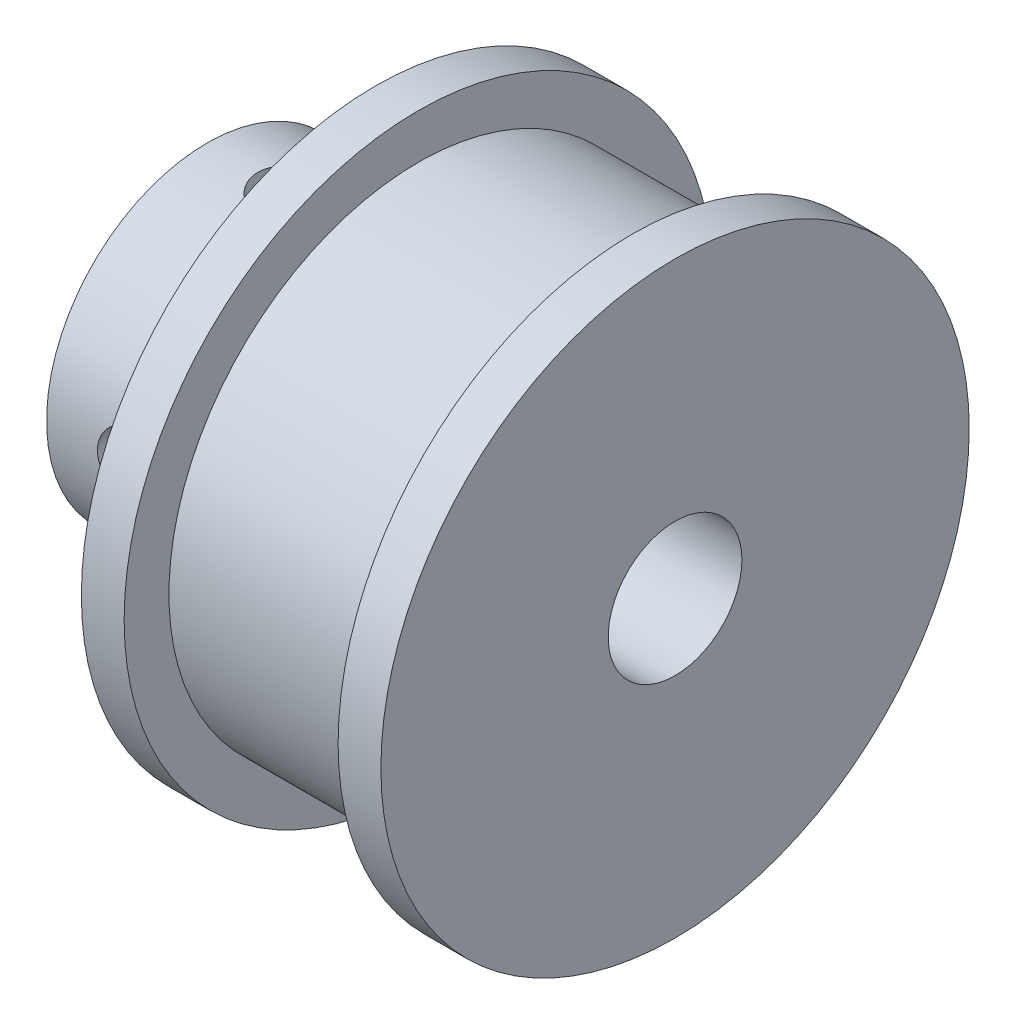
ISO-10303-21;
HEADER;
FILE_DESCRIPTION(('STEP AP214'),'2;1');
FILE_NAME('part.step','',(''),(''),'','','');
FILE_SCHEMA(('AUTOMOTIVE_DESIGN { 1 0 10303 214 1 1 1 1 }'));
ENDSEC;
DATA;
#1=APPLICATION_CONTEXT('core data for automotive mechanical design processes');
#2=APPLICATION_PROTOCOL_DEFINITION('international standard','automotive_design',2000,#1);
#3=PRODUCT_CONTEXT('',#1,'mechanical');
#4=PRODUCT('Part','Part','',(#3));
#5=PRODUCT_RELATED_PRODUCT_CATEGORY('part','',(#4));
#6=PRODUCT_DEFINITION_FORMATION('','',#4);
#7=PRODUCT_DEFINITION_CONTEXT('part definition',#1,'design');
#8=PRODUCT_DEFINITION('design','',#6,#7);
#9=PRODUCT_DEFINITION_SHAPE('','',#8);
#10=(LENGTH_UNIT() NAMED_UNIT(*) SI_UNIT(.MILLI.,.METRE.));
#11=(NAMED_UNIT(*) PLANE_ANGLE_UNIT() SI_UNIT($,.RADIAN.));
#12=(NAMED_UNIT(*) SI_UNIT($,.STERADIAN.) SOLID_ANGLE_UNIT());
#13=UNCERTAINTY_MEASURE_WITH_UNIT(LENGTH_MEASURE(1.E-05),#10,'distance_accuracy_value','');
#14=(GEOMETRIC_REPRESENTATION_CONTEXT(3) GLOBAL_UNCERTAINTY_ASSIGNED_CONTEXT((#13)) GLOBAL_UNIT_ASSIGNED_CONTEXT((#10,
#11,#12)) REPRESENTATION_CONTEXT('',''));
#15=CARTESIAN_POINT('',(0.,0.,0.));
#16=DIRECTION('',(0.,0.,1.));
#17=DIRECTION('',(1.,0.,0.));
#18=AXIS2_PLACEMENT_3D('',#15,#16,#17);
#19=CARTESIAN_POINT('',(0.,0.,0.));
#20=DIRECTION('',(1.,0.,0.));
#21=DIRECTION('',(0.,0.,-1.));
#22=AXIS2_PLACEMENT_3D('',#19,#20,#21);
#23=CYLINDRICAL_SURFACE('',#22,2.5);
#24=CARTESIAN_POINT('',(1.90000000000001,0.,2.5));
#25=CARTESIAN_POINT('',(1.90000412789938,0.0657149536912328,2.49999641755189));
#26=CARTESIAN_POINT('',(1.9052125914021,0.13150824962254,2.49738113774397));
#27=CARTESIAN_POINT('',(1.92581610042616,0.26115029408553,2.48717695046745));
#28=CARTESIAN_POINT('',(1.94123049124707,0.324995108391878,2.4795785978623));
#29=CARTESIAN_POINT('',(1.981492260771,0.448666931100716,2.4602034925414));
#30=CARTESIAN_POINT('',(2.00630298031002,0.508508503673972,2.448442989719));
#31=CARTESIAN_POINT('',(2.06446327670618,0.623090771008203,2.42182220644723));
#32=CARTESIAN_POINT('',(2.09781218031107,0.677831867487559,2.40696217041913));
#33=CARTESIAN_POINT('',(2.17439656185663,0.784384772202395,2.37445322822571));
#34=CARTESIAN_POINT('',(2.21810809904956,0.835819013902635,2.3566899890942));
#35=CARTESIAN_POINT('',(2.3131518490588,0.930974306083717,2.32074962808431));
#36=CARTESIAN_POINT('',(2.36448981471556,0.974689478883453,2.30257220261294));
#37=CARTESIAN_POINT('',(2.47810418690423,1.05656500056284,2.26623688996684));
#38=CARTESIAN_POINT('',(2.5409201229324,1.09403166943954,2.24818983712665));
#39=CARTESIAN_POINT('',(2.67295916998277,1.15771028361336,2.21607473465401));
#40=CARTESIAN_POINT('',(2.74217766090344,1.18393026870791,2.20200384508737));
#41=CARTESIAN_POINT('',(2.88083138177741,1.22266555273573,2.18072333797261));
#42=CARTESIAN_POINT('',(2.95000556508425,1.23590732135054,2.17315339479642));
#43=CARTESIAN_POINT('',(3.08997354722435,1.25053374163605,2.1647736243566));
#44=CARTESIAN_POINT('',(3.16076567608894,1.25193011046634,2.16395711679111));
#45=CARTESIAN_POINT('',(3.29285753039421,1.24335910896536,2.16888662821561));
#46=CARTESIAN_POINT('',(3.35428003902881,1.23473069942102,2.17385954577517));
#47=CARTESIAN_POINT('',(3.4746523867163,1.20867481132116,2.18845285917313));
#48=CARTESIAN_POINT('',(3.53360143163164,1.19124452987206,2.19807473539721));
#49=CARTESIAN_POINT('',(3.64903641570707,1.1477622254825,2.22109345515927));
#50=CARTESIAN_POINT('',(3.70543299848223,1.12151883389499,2.23457300829999));
#51=CARTESIAN_POINT('',(3.81329286573751,1.061302109585,2.26379255351755));
#52=CARTESIAN_POINT('',(3.86475391950011,1.02732530476558,2.27953355975239));
#53=CARTESIAN_POINT('',(3.96815156592903,0.947582568640978,2.31391447379108));
#54=CARTESIAN_POINT('',(4.01932109197019,0.900868072961595,2.33266887795933));
#55=CARTESIAN_POINT('',(4.11341927323862,0.799444473426711,2.36934529125509));
#56=CARTESIAN_POINT('',(4.15634399004235,0.744731570717851,2.38726689948501));
#57=CARTESIAN_POINT('',(4.23460707628715,0.625645632289805,2.42127484103705));
#58=CARTESIAN_POINT('',(4.26950059055717,0.560941989499256,2.43723730202509));
#59=CARTESIAN_POINT('',(4.32762128630376,0.425582769360992,2.46447351401553));
#60=CARTESIAN_POINT('',(4.35085773126895,0.354931970331592,2.47575098679441));
#61=CARTESIAN_POINT('',(4.38309425464584,0.215958114575874,2.49155417176795));
#62=CARTESIAN_POINT('',(4.39311404468347,0.147926913185403,2.4965617287664));
#63=CARTESIAN_POINT('',(4.40183091391811,0.0109744999366904,2.50091266823877));
#64=CARTESIAN_POINT('',(4.40053335704934,-0.0579462748373779,2.5002587340164));
#65=CARTESIAN_POINT('',(4.38724163947655,-0.189041214982493,2.49363990316801));
#66=CARTESIAN_POINT('',(4.37608433408746,-0.251324260062443,2.48809057110237));
#67=CARTESIAN_POINT('',(4.34470241013114,-0.373008615377396,2.47277714143524));
#68=CARTESIAN_POINT('',(4.32447679193329,-0.432409607113745,2.46301257917916));
#69=CARTESIAN_POINT('',(4.27500191695853,-0.54861076056208,2.43980314267087));
#70=CARTESIAN_POINT('',(4.24551118735398,-0.60528799625769,2.42626102212424));
#71=CARTESIAN_POINT('',(4.17861558044244,-0.713076702123649,2.39679967896386));
#72=CARTESIAN_POINT('',(4.1412073317582,-0.7641857872191,2.38087944457232));
#73=CARTESIAN_POINT('',(4.0552994683339,-0.864709611613313,2.34635276671831));
#74=CARTESIAN_POINT('',(4.00607141443304,-0.913465097280795,2.32763606060552));
#75=CARTESIAN_POINT('',(3.90009356091336,-1.00232040139155,2.29077989504843));
#76=CARTESIAN_POINT('',(3.84333860147953,-1.04241423211355,2.27264084226908));
#77=CARTESIAN_POINT('',(3.72044543224961,-1.11463489312211,2.23813990282585));
#78=CARTESIAN_POINT('',(3.65398591723925,-1.14628186984829,2.2219066207934));
#79=CARTESIAN_POINT('',(3.51561241538434,-1.19760353251725,2.19467590460158));
#80=CARTESIAN_POINT('',(3.44370559187351,-1.21729364485946,2.18367172800773));
#81=CARTESIAN_POINT('',(3.30386222142319,-1.24232710931209,2.16951876260834));
#82=CARTESIAN_POINT('',(3.2362071832137,-1.24886624550107,2.16571729325615));
#83=CARTESIAN_POINT('',(3.10069116603659,-1.25086144297598,2.16456693307719));
#84=CARTESIAN_POINT('',(3.03283028907571,-1.24632230828049,2.16721524534441));
#85=CARTESIAN_POINT('',(2.90564562308498,-1.22740765699032,2.17797327562531));
#86=CARTESIAN_POINT('',(2.8461244123195,-1.21401039292849,2.18553868102993));
#87=CARTESIAN_POINT('',(2.73023985071912,-1.1789691977808,2.20463770234897));
#88=CARTESIAN_POINT('',(2.67387752238504,-1.15732261394975,2.21617259462095));
#89=CARTESIAN_POINT('',(2.56171893626674,-1.10476968162585,2.24285662955661));
#90=CARTESIAN_POINT('',(2.50621512271288,-1.07333892227056,2.25819652995239));
#91=CARTESIAN_POINT('',(2.40090682977427,-1.00268871454578,2.29044164543238));
#92=CARTESIAN_POINT('',(2.35110533685189,-0.963465214048302,2.30734767243153));
#93=CARTESIAN_POINT('',(2.25232252205298,-0.872754158330794,2.34327903949142));
#94=CARTESIAN_POINT('',(2.2041761220476,-0.820355528762706,2.36231229139336));
#95=CARTESIAN_POINT('',(2.11717127072046,-0.707693507775342,2.3984719031886));
#96=CARTESIAN_POINT('',(2.07831782571714,-0.647425904070974,2.4155972326005));
#97=CARTESIAN_POINT('',(2.01095454654725,-0.519914496024927,2.44622511981379));
#98=CARTESIAN_POINT('',(1.98251978823571,-0.452624379918261,2.45970120703636));
#99=CARTESIAN_POINT('',(1.93773979010132,-0.313427626617733,2.48126676704332));
#100=CARTESIAN_POINT('',(1.92136019146304,-0.241534749528952,2.48937154216165));
#101=CARTESIAN_POINT('',(1.9076282361552,-0.140752433104225,2.49619327387079));
#102=CARTESIAN_POINT('',(1.90477169892048,-0.112702349299369,2.49761706674002));
#103=CARTESIAN_POINT('',(1.900956668104,-0.0564396647589448,2.49952121222331));
#104=CARTESIAN_POINT('',(1.89999822691101,-0.0282270595592256,2.50000153879704));
#105=CARTESIAN_POINT('',(1.90000000000001,0.,2.5));
#106=B_SPLINE_CURVE_WITH_KNOTS('',3,(#24,#25,#26,#27,#28,#29,#30,#31,#32,#33,#34,#35,#36,#37,
#38,#39,#40,#41,#42,#43,#44,#45,#46,#47,#48,#49,#50,#51,#52,#53,#54,#55,#56,#57,#58,#59,#60,#61,
#62,#63,#64,#65,#66,#67,#68,#69,#70,#71,#72,#73,#74,#75,#76,#77,#78,#79,#80,#81,#82,#83,#84,#85,
#86,#87,#88,#89,#90,#91,#92,#93,#94,#95,#96,#97,#98,#99,#100,#101,#102,#103,#104,#105),
.UNSPECIFIED.,.T.,.F.,(4,2,2,2,2,2,2,2,2,2,2,2,2,2,2,2,2,2,2,2,2,2,2,2,2,2,2,2,2,2,2,2,2,2,2,2,
2,2,2,2,4),(0.,0.197030321775365,0.394435187136495,0.59107769436537,0.787704700726955,
0.996227198397605,1.20490779706754,1.4297715803844,1.6544743487285,1.86572515175286,
2.07676696661274,2.26257140511649,2.44843504907097,2.63862800210608,2.82890651575276,
3.04331176667346,3.25781918248356,3.48228777768049,3.70657771140347,3.9122911308918,
4.11790705639343,4.3075863313265,4.49728652038662,4.6924107003487,4.88761813435421,
5.10199513305521,5.31651985769287,5.54143352699589,5.76605639925969,5.96911634372963,
6.17208824825003,6.35572412805224,6.53941910979594,6.73545570969514,6.93159451423693,
7.15156553440619,7.37165479220712,7.59330017078652,7.81431135781158,7.89894100172117,
7.98357298143554),.UNSPECIFIED.);
#107=CARTESIAN_POINT('',(1.90000000000001,0.,2.5));
#108=VERTEX_POINT('',#107);
#109=EDGE_CURVE('E3636',#108,#108,#106,.T.);
#110=ORIENTED_EDGE('',*,*,#109,.F.);
#111=EDGE_LOOP('',(#110));
#112=FACE_BOUND('',#111,.T.);
#113=CARTESIAN_POINT('',(3.15,2.1650635094611,-1.25));
#114=CARTESIAN_POINT('',(3.21513476024406,2.16506918410574,-1.24999545384316));
#115=CARTESIAN_POINT('',(3.28035176440631,2.16804751484696,-1.24487496341652));
#116=CARTESIAN_POINT('',(3.40878408084644,2.17952958065066,-1.22465401237257));
#117=CARTESIAN_POINT('',(3.47199489380426,2.18804492569449,-1.20953258069272));
#118=CARTESIAN_POINT('',(3.59431458042993,2.20936683256748,-1.17012493587476));
#119=CARTESIAN_POINT('',(3.65344331559198,2.22215054341565,-1.14588744061716));
#120=CARTESIAN_POINT('',(3.7667802524959,2.25053331021072,-1.08908440672046));
#121=CARTESIAN_POINT('',(3.82098818782807,2.26613251845081,-1.05651841754472));
#122=CARTESIAN_POINT('',(3.92788216069688,2.29996086321802,-0.980833175663597));
#123=CARTESIAN_POINT('',(3.98007391959193,2.31830079547442,-0.937065045179712));
#124=CARTESIAN_POINT('',(4.07676048550839,2.35464978482132,-0.841567259518084));
#125=CARTESIAN_POINT('',(4.1212514532294,2.37265867289062,-0.789833657227865));
#126=CARTESIAN_POINT('',(4.20420893893458,2.40776846191186,-0.675611954268182));
#127=CARTESIAN_POINT('',(4.24206720982441,2.42472633022716,-0.612633986265718));
#128=CARTESIAN_POINT('',(4.3064260665572,2.45438445124411,-0.480196283249379));
#129=CARTESIAN_POINT('',(4.33293382017146,2.46708738979677,-0.410740672672693));
#130=CARTESIAN_POINT('',(4.37188082662637,2.48600576555297,-0.272556179907471));
#131=CARTESIAN_POINT('',(4.38518690794442,2.49261850276115,-0.204127238111022));
#132=CARTESIAN_POINT('',(4.4002076483438,2.50009479807584,-0.0657132858723104));
#133=CARTESIAN_POINT('',(4.40192932099464,2.50096183480737,0.00427075730467285));
#134=CARTESIAN_POINT('',(4.39406665753706,2.49703727395563,0.137290655529687));
#135=CARTESIAN_POINT('',(4.38545248059847,2.49273119865201,0.200401498970989));
#136=CARTESIAN_POINT('',(4.35889894511918,2.47967806574684,0.324142214897902));
#137=CARTESIAN_POINT('',(4.34095888877972,2.47093067582992,0.384771901367406));
#138=CARTESIAN_POINT('',(4.29614679238773,2.44964479109568,0.502886739461941));
#139=CARTESIAN_POINT('',(4.26915460853492,2.43705551911499,0.560316779393972));
#140=CARTESIAN_POINT('',(4.20717072974813,2.40922057483359,0.66997100189166));
#141=CARTESIAN_POINT('',(4.17217617087206,2.39397395196855,0.722193311048306));
#142=CARTESIAN_POINT('',(4.09138081058373,2.36055492999037,0.825217076122743));
#143=CARTESIAN_POINT('',(4.04487121459249,2.34224219997719,0.8754175937867));
#144=CARTESIAN_POINT('',(3.94426284383728,2.30567925733515,0.967630462872224));
#145=CARTESIAN_POINT('',(3.89015828465742,2.28742910332036,1.00963651446779));
#146=CARTESIAN_POINT('',(3.77168975946989,2.25180195115606,1.08688166830276));
#147=CARTESIAN_POINT('',(3.70689247118224,2.23455399988385,1.12152164372256));
#148=CARTESIAN_POINT('',(3.57132791080125,2.2046931284822,1.17914889125154));
#149=CARTESIAN_POINT('',(3.50056695872805,2.19207537557584,1.20214832276361));
#150=CARTESIAN_POINT('',(3.36098186089651,2.17430794771293,1.2339752637813));
#151=CARTESIAN_POINT('',(3.29244860119556,2.16864569810621,1.24378140264997));
#152=CARTESIAN_POINT('',(3.15449832310432,2.16397399202012,1.25189618326428));
#153=CARTESIAN_POINT('',(3.08508196360027,2.1649598361164,1.25021294664378));
#154=CARTESIAN_POINT('',(2.95543260177659,2.17292920675731,1.23629505417996));
#155=CARTESIAN_POINT('',(2.89502568611509,2.17924484383318,1.22523477089058));
#156=CARTESIAN_POINT('',(2.7770402671613,2.19617526939177,1.19462035579055));
#157=CARTESIAN_POINT('',(2.71946268656674,2.20679145006292,1.17506347327952));
#158=CARTESIAN_POINT('',(2.60573583637163,2.23170277599571,1.12705948575611));
#159=CARTESIAN_POINT('',(2.54977622893306,2.24614554053829,1.0982425796159));
#160=CARTESIAN_POINT('',(2.44316341057626,2.27695149371562,1.03285883001975));
#161=CARTESIAN_POINT('',(2.3925129456084,2.29331566693935,0.996288005415269));
#162=CARTESIAN_POINT('',(2.29127654059557,2.3285999807042,0.911046458998566));
#163=CARTESIAN_POINT('',(2.24150356160293,2.34758228942861,0.861431590393707));
#164=CARTESIAN_POINT('',(2.15073470250801,2.38417793722366,0.754255619247859));
#165=CARTESIAN_POINT('',(2.10974178721183,2.40179081259637,0.696691843319182));
#166=CARTESIAN_POINT('',(2.03678284256238,2.43426702113696,0.573169203198445));
#167=CARTESIAN_POINT('',(2.00508360223636,2.44904552090037,0.50702887196764));
#168=CARTESIAN_POINT('',(1.95357762017826,2.47354193699126,0.369402955801352));
#169=CARTESIAN_POINT('',(1.93376043579212,2.48326429595466,0.297922126740219));
#170=CARTESIAN_POINT('',(1.90828929478168,2.49584385227353,0.158724602913021));
#171=CARTESIAN_POINT('',(1.90150265515486,2.49924909885239,0.0912643048130704));
#172=CARTESIAN_POINT('',(1.898945918182,2.50052662968914,-0.0439074824390051));
#173=CARTESIAN_POINT('',(1.90317196434555,2.49840085083612,-0.111618875368859));
#174=CARTESIAN_POINT('',(1.92177050849453,2.48917461047403,-0.240672490396434));
#175=CARTESIAN_POINT('',(1.93545606157209,2.48241118334987,-0.30214039726408));
#176=CARTESIAN_POINT('',(1.97165874912872,2.46490117079279,-0.421807440229522));
#177=CARTESIAN_POINT('',(1.99417715011682,2.45415401415995,-0.480006106194386));
#178=CARTESIAN_POINT('',(2.04840881520747,2.4290741343515,-0.594279257806106));
#179=CARTESIAN_POINT('',(2.0804741540098,2.41460771498499,-0.650156428375058));
#180=CARTESIAN_POINT('',(2.15244741357382,2.38360166427283,-0.755968302267531));
#181=CARTESIAN_POINT('',(2.19235893639459,2.36706108197951,-0.805900259268634));
#182=CARTESIAN_POINT('',(2.28349642377838,2.33160762783285,-0.903642505196113));
#183=CARTESIAN_POINT('',(2.33545310934649,2.31262248764622,-0.950747105674089));
#184=CARTESIAN_POINT('',(2.44681340141222,2.27578845203566,-1.03582910924334));
#185=CARTESIAN_POINT('',(2.50622352608461,2.25794057202332,-1.07379843751257));
#186=CARTESIAN_POINT('',(2.6332958082262,2.22499506631145,-1.14053884973207));
#187=CARTESIAN_POINT('',(2.70115941391092,2.21000217820338,-1.16898133245117));
#188=CARTESIAN_POINT('',(2.84166550542472,2.1858269541044,-1.21359838688301));
#189=CARTESIAN_POINT('',(2.91429111114086,2.17662520184628,-1.22981398896918));
#190=CARTESIAN_POINT('',(3.014756694565,2.16911590752238,-1.24295875983052));
#191=CARTESIAN_POINT('',(3.04170986799736,2.1676016125644,-1.24559513120481));
#192=CARTESIAN_POINT('',(3.09577060085281,2.16557419859688,-1.24911675636245));
#193=CARTESIAN_POINT('',(3.12287817048234,2.16506114656387,-1.25000189299984));
#194=CARTESIAN_POINT('',(3.15,2.1650635094611,-1.25));
#195=B_SPLINE_CURVE_WITH_KNOTS('',3,(#113,#114,#115,#116,#117,#118,#119,#120,#121,#122,#123,
#124,#125,#126,#127,#128,#129,#130,#131,#132,#133,#134,#135,#136,#137,#138,#139,#140,#141,#142,
#143,#144,#145,#146,#147,#148,#149,#150,#151,#152,#153,#154,#155,#156,#157,#158,#159,#160,#161,
#162,#163,#164,#165,#166,#167,#168,#169,#170,#171,#172,#173,#174,#175,#176,#177,#178,#179,#180,
#181,#182,#183,#184,#185,#186,#187,#188,#189,#190,#191,#192,#193,#194),.UNSPECIFIED.,.T.,.F.,(4,
2,2,2,2,2,2,2,2,2,2,2,2,2,2,2,2,2,2,2,2,2,2,2,2,2,2,2,2,2,2,2,2,2,2,2,2,2,2,2,4),(0.,
0.195290153243394,0.390991116031006,0.585660744898607,0.780340906806436,0.991077890622791,
1.20191963855464,1.42697365298454,1.65188533704864,1.86079356209919,2.0695752960755,
2.26020121855673,2.45084140646819,2.64411918413933,2.83746624187839,3.04908989321113,
3.26087560307398,3.4861105216181,3.71110967764631,3.91827863567764,4.12530116485466,
4.30967729280031,4.49411315545078,4.68709120507609,4.88016857775059,5.09758429475766,
5.31507331222752,5.53830226766207,5.76133474760964,5.96390337986858,6.16640108492464,
6.35555531089365,6.54473666890015,6.74200938399339,6.93937287625898,7.15637802312583,
7.37357428556442,7.59763436298255,7.82093916253449,7.90225168981636,7.98356965618175),.UNSPECIFIED.);
#196=CARTESIAN_POINT('',(3.15,2.1650635094611,-1.25));
#197=VERTEX_POINT('',#196);
#198=EDGE_CURVE('E3635',#197,#197,#195,.T.);
#199=ORIENTED_EDGE('',*,*,#198,.F.);
#200=EDGE_LOOP('',(#199));
#201=FACE_BOUND('',#200,.T.);
#202=CARTESIAN_POINT('',(17.5,0.,0.));
#203=DIRECTION('',(1.,0.,0.));
#204=DIRECTION('',(0.,0.,-1.));
#205=AXIS2_PLACEMENT_3D('',#202,#203,#204);
#206=CIRCLE('',#205,2.5);
#207=CARTESIAN_POINT('',(17.5,0.,-2.5));
#208=VERTEX_POINT('',#207);
#209=EDGE_CURVE('E3657',#208,#208,#206,.T.);
#210=ORIENTED_EDGE('',*,*,#209,.T.);
#211=EDGE_LOOP('',(#210));
#212=FACE_BOUND('',#211,.T.);
#213=CARTESIAN_POINT('',(0.,0.,0.));
#214=DIRECTION('',(1.,0.,0.));
#215=DIRECTION('',(0.,0.,-1.));
#216=AXIS2_PLACEMENT_3D('',#213,#214,#215);
#217=CIRCLE('',#216,2.5);
#218=CARTESIAN_POINT('',(0.,0.,-2.5));
#219=VERTEX_POINT('',#218);
#220=EDGE_CURVE('E12',#219,#219,#217,.T.);
#221=ORIENTED_EDGE('',*,*,#220,.F.);
#222=EDGE_LOOP('',(#221));
#223=FACE_BOUND('',#222,.T.);
#224=ADVANCED_FACE('F3608',(#112,#201,#212,#223),#23,.F.);
#225=CARTESIAN_POINT('',(0.,2.5,0.));
#226=DIRECTION('',(-1.,0.,0.));
#227=DIRECTION('',(0.,0.,1.));
#228=AXIS2_PLACEMENT_3D('',#225,#226,#227);
#229=PLANE('',#228);
#230=ORIENTED_EDGE('',*,*,#220,.T.);
#231=EDGE_LOOP('',(#230));
#232=FACE_BOUND('',#231,.T.);
#233=CARTESIAN_POINT('',(0.,0.,0.));
#234=DIRECTION('',(1.,0.,0.));
#235=DIRECTION('',(0.,0.,-1.));
#236=AXIS2_PLACEMENT_3D('',#233,#234,#235);
#237=CIRCLE('',#236,6.);
#238=CARTESIAN_POINT('',(0.,0.,-6.));
#239=VERTEX_POINT('',#238);
#240=EDGE_CURVE('E3621',#239,#239,#237,.T.);
#241=ORIENTED_EDGE('',*,*,#240,.F.);
#242=EDGE_LOOP('',(#241));
#243=FACE_BOUND('',#242,.T.);
#244=ADVANCED_FACE('F3687',(#232,#243),#229,.T.);
#245=CARTESIAN_POINT('',(0.,0.,0.));
#246=DIRECTION('',(1.,0.,0.));
#247=DIRECTION('',(0.,0.,-1.));
#248=AXIS2_PLACEMENT_3D('',#245,#246,#247);
#249=CYLINDRICAL_SURFACE('',#248,6.);
#250=CARTESIAN_POINT('',(1.90000000000001,0.,6.));
#251=CARTESIAN_POINT('',(1.90000247746923,-0.0694090417016603,5.99999871526651));
#252=CARTESIAN_POINT('',(1.90580066571876,-0.138848789520875,5.99878328775043));
#253=CARTESIAN_POINT('',(1.92881934953286,-0.275761316266992,5.99405200990679));
#254=CARTESIAN_POINT('',(1.94604852303694,-0.343232560128311,5.99053441189248));
#255=CARTESIAN_POINT('',(1.99137045492183,-0.474209132291339,5.98159109196202));
#256=CARTESIAN_POINT('',(2.01945239599889,-0.537718336709182,5.97616727052645));
#257=CARTESIAN_POINT('',(2.08564960885619,-0.659120328605954,5.96399927809859));
#258=CARTESIAN_POINT('',(2.12376443115584,-0.717013367534323,5.95725516625975));
#259=CARTESIAN_POINT('',(2.20953634019065,-0.826390324308832,5.9430770002465));
#260=CARTESIAN_POINT('',(2.25731200123509,-0.87778024416268,5.93563505848531));
#261=CARTESIAN_POINT('',(2.36079465919511,-0.971877776769387,5.92095657692448));
#262=CARTESIAN_POINT('',(2.41650231187227,-1.01458467096098,5.91372005416683));
#263=CARTESIAN_POINT('',(2.53495196876616,-1.09051031677216,5.90019442595308));
#264=CARTESIAN_POINT('',(2.59775838450275,-1.1236305468065,5.89391545174828));
#265=CARTESIAN_POINT('',(2.72819745177276,-1.17881119348063,5.8831284065002));
#266=CARTESIAN_POINT('',(2.79582958244254,-1.20087280167641,5.87862014467568));
#267=CARTESIAN_POINT('',(2.93298523741564,-1.23300240133736,5.87196500986123));
#268=CARTESIAN_POINT('',(3.00246835933477,-1.24323597696798,5.86978556855865));
#269=CARTESIAN_POINT('',(3.14219684286263,-1.25193357655614,5.86793690716491));
#270=CARTESIAN_POINT('',(3.2124421188653,-1.25039890894686,5.86826740800981));
#271=CARTESIAN_POINT('',(3.35048102797518,-1.23573719037196,5.87137174319175));
#272=CARTESIAN_POINT('',(3.41829597966121,-1.2228010523272,5.87410533679901));
#273=CARTESIAN_POINT('',(3.55077150964493,-1.18600543529945,5.88164437615942));
#274=CARTESIAN_POINT('',(3.61543192560633,-1.16214539481381,5.88644992841317));
#275=CARTESIAN_POINT('',(3.74030722841598,-1.10400003213928,5.89763191464102));
#276=CARTESIAN_POINT('',(3.80048629652707,-1.06964002534236,5.90401953785586));
#277=CARTESIAN_POINT('',(3.91429574426816,-0.991522699274812,5.91763890010721));
#278=CARTESIAN_POINT('',(3.96792530883597,-0.947764212262582,5.92487074398537));
#279=CARTESIAN_POINT('',(4.06821396108037,-0.851074921546777,5.93953730929909));
#280=CARTESIAN_POINT('',(4.11471616889701,-0.797981433412077,5.94697323199473));
#281=CARTESIAN_POINT('',(4.19818044222897,-0.684667288611794,5.96108088143001));
#282=CARTESIAN_POINT('',(4.23514236459839,-0.624446525025762,5.96775259670236));
#283=CARTESIAN_POINT('',(4.29851008153595,-0.498405541235475,5.97959870942815));
#284=CARTESIAN_POINT('',(4.32489680456711,-0.432575461926497,5.98477039710258));
#285=CARTESIAN_POINT('',(4.36619170483549,-0.297284620972153,5.99301338211281));
#286=CARTESIAN_POINT('',(4.38110139323139,-0.227824338595088,5.99608495596053));
#287=CARTESIAN_POINT('',(4.39879425206788,-0.0885918657008349,5.99974275215455));
#288=CARTESIAN_POINT('',(4.40179194149424,-0.0188480555261788,6.00037293537579));
#289=CARTESIAN_POINT('',(4.39615505003089,0.120143798757714,5.99919952252774));
#290=CARTESIAN_POINT('',(4.3875211813984,0.189391872962257,5.99739607548153));
#291=CARTESIAN_POINT('',(4.35904434653046,0.324726367119811,5.99158564979184));
#292=CARTESIAN_POINT('',(4.33931251461653,0.390837192894204,5.98760052868077));
#293=CARTESIAN_POINT('',(4.28932213957859,0.518811446661328,5.97787227242395));
#294=CARTESIAN_POINT('',(4.25906275913401,0.580674536336772,5.97212899744579));
#295=CARTESIAN_POINT('',(4.18841962176244,0.69929430694349,5.95941241490714));
#296=CARTESIAN_POINT('',(4.14790807043093,0.755973219469829,5.9524239381233));
#297=CARTESIAN_POINT('',(4.05808043692373,0.861805445886515,5.93802568299709));
#298=CARTESIAN_POINT('',(4.00876332448106,0.910957877913281,5.93061585542511));
#299=CARTESIAN_POINT('',(3.9017444230003,1.0011786486518,5.91606024531377));
#300=CARTESIAN_POINT('',(3.84391696804472,1.04209914600204,5.90892089307501));
#301=CARTESIAN_POINT('',(3.72208371578621,1.11364719079243,5.89585601015805));
#302=CARTESIAN_POINT('',(3.65807817586089,1.14427516677863,5.88993042894651));
#303=CARTESIAN_POINT('',(3.52603880370177,1.19417246443921,5.88001700708041));
#304=CARTESIAN_POINT('',(3.45802896283416,1.21350309828031,5.87601872784687));
#305=CARTESIAN_POINT('',(3.31963344950774,1.24044038523407,5.87039184709697));
#306=CARTESIAN_POINT('',(3.24924811838056,1.2480487154444,5.86876290660367));
#307=CARTESIAN_POINT('',(3.10958659900035,1.25125926487611,5.86807907308506));
#308=CARTESIAN_POINT('',(3.04031592977795,1.24709542622725,5.86897402321502));
#309=CARTESIAN_POINT('',(2.90348599107978,1.22739905314031,5.87312447254928));
#310=CARTESIAN_POINT('',(2.8359267051839,1.21186662782265,5.87637994909626));
#311=CARTESIAN_POINT('',(2.70460222810934,1.16998217768584,5.88486132447716));
#312=CARTESIAN_POINT('',(2.64082675351308,1.14366117568421,5.8900815700793));
#313=CARTESIAN_POINT('',(2.51856122397334,1.08097457299757,5.90190705738738));
#314=CARTESIAN_POINT('',(2.46007166036688,1.04460803983029,5.9085124276546));
#315=CARTESIAN_POINT('',(2.34887837292056,0.962073695342405,5.92251579551146));
#316=CARTESIAN_POINT('',(2.29630087543502,0.91573789041822,5.92992613868404));
#317=CARTESIAN_POINT('',(2.19959050677365,0.814924438115329,5.94461839583213));
#318=CARTESIAN_POINT('',(2.15545958244852,0.760444918832963,5.9519002798488));
#319=CARTESIAN_POINT('',(2.07641142681595,0.644134427507699,5.96561444547637));
#320=CARTESIAN_POINT('',(2.04160632011372,0.582225921521345,5.97203596073244));
#321=CARTESIAN_POINT('',(1.98294977156998,0.453319843998451,5.98319908494092));
#322=CARTESIAN_POINT('',(1.95908875281813,0.386326781907242,5.98794216182101));
#323=CARTESIAN_POINT('',(1.92745972171158,0.266015292900104,5.99432499781443));
#324=CARTESIAN_POINT('',(1.91718123679115,0.213367593727928,5.99644035661395));
#325=CARTESIAN_POINT('',(1.90345054572268,0.107152674176536,5.99927832789758));
#326=CARTESIAN_POINT('',(1.89999808733282,0.0535854878488715,6.00000099184586));
#327=CARTESIAN_POINT('',(1.90000000000001,0.,6.));
#328=B_SPLINE_CURVE_WITH_KNOTS('',3,(#250,#251,#252,#253,#254,#255,#256,#257,#258,#259,#260,
#261,#262,#263,#264,#265,#266,#267,#268,#269,#270,#271,#272,#273,#274,#275,#276,#277,#278,#279,
#280,#281,#282,#283,#284,#285,#286,#287,#288,#289,#290,#291,#292,#293,#294,#295,#296,#297,#298,
#299,#300,#301,#302,#303,#304,#305,#306,#307,#308,#309,#310,#311,#312,#313,#314,#315,#316,#317,
#318,#319,#320,#321,#322,#323,#324,#325,#326,#327),.UNSPECIFIED.,.T.,.F.,(4,2,2,2,2,2,2,2,2,2,2,
2,2,2,2,2,2,2,2,2,2,2,2,2,2,2,2,2,2,2,2,2,2,2,2,2,2,2,4),(0.,0.208031045103182,
0.416220199906223,0.624202378825439,0.832175241572985,1.04287526388122,1.25359271551785,
1.46640449178548,1.67919333285489,1.88896575169853,2.09871484767163,2.30501712129058,
2.51133000030278,2.71914592416748,2.92698768368033,3.13889526355464,3.35080602278216,
3.5630972449966,3.77536051045769,3.98378339407673,4.19219351552275,4.39855286632619,
4.60492863390931,4.81401583995734,5.02312752564571,5.23571263829333,5.44828889851306,
5.65970050095022,5.87108185414182,6.07829223291035,6.28550062281358,6.49211731393252,
6.69875319081476,6.90919024830305,7.11967575117366,7.33258864398252,7.54531486464969,
7.70592588477276,7.86653096973387),.UNSPECIFIED.);
#329=CARTESIAN_POINT('',(1.90000000000001,0.,6.));
#330=VERTEX_POINT('',#329);
#331=EDGE_CURVE('E3612',#330,#330,#328,.T.);
#332=ORIENTED_EDGE('',*,*,#331,.F.);
#333=EDGE_LOOP('',(#332));
#334=FACE_BOUND('',#333,.T.);
#335=CARTESIAN_POINT('',(3.15,5.86834729715275,-1.25));
#336=CARTESIAN_POINT('',(3.08060938484897,5.86834869213645,-1.24999750877599));
#337=CARTESIAN_POINT('',(3.01118802798478,5.86959145924544,-1.24420229433948));
#338=CARTESIAN_POINT('',(2.87431368268275,5.87442015581798,-1.22119649233779));
#339=CARTESIAN_POINT('',(2.80686224449358,5.87800788138388,-1.20397715440342));
#340=CARTESIAN_POINT('',(2.67592762716513,5.8871029296193,-1.1586839750723));
#341=CARTESIAN_POINT('',(2.6124404040082,5.89260825706945,-1.13062141248932));
#342=CARTESIAN_POINT('',(2.4910755003544,5.90491581335741,-1.06446988601732));
#343=CARTESIAN_POINT('',(2.43319759326998,5.91171798977622,-1.0263813273582));
#344=CARTESIAN_POINT('',(2.32380462484654,5.92596934661468,-0.940636399466082));
#345=CARTESIAN_POINT('',(2.27238810637353,5.93342614373039,-0.892855554869668));
#346=CARTESIAN_POINT('',(2.1782389313519,5.94807966802575,-0.789351223880636));
#347=CARTESIAN_POINT('',(2.13550691170856,5.95527637609915,-0.733627155456002));
#348=CARTESIAN_POINT('',(2.05955411191714,5.96868135118848,-0.615162052999588));
#349=CARTESIAN_POINT('',(2.02642747353674,5.97487958631242,-0.552359428204941));
#350=CARTESIAN_POINT('',(1.97123394714022,5.98550347343302,-0.421928551006719));
#351=CARTESIAN_POINT('',(1.94916593484647,5.98992930561222,-0.354300789950591));
#352=CARTESIAN_POINT('',(1.91702423888253,5.99645589892179,-0.217162904200502));
#353=CARTESIAN_POINT('',(1.90678398280484,5.99858891959926,-0.147693380916357));
#354=CARTESIAN_POINT('',(1.89806830424298,6.00040112580612,-0.00799184883952432));
#355=CARTESIAN_POINT('',(1.8995916558069,6.0000805670369,0.0622400797368385));
#356=CARTESIAN_POINT('',(1.91423460095674,5.99704658090511,0.200326586199572));
#357=CARTESIAN_POINT('',(1.92717471895812,5.99437018956584,0.268201128726475));
#358=CARTESIAN_POINT('',(1.96399862533131,5.98696720898885,0.400793746289752));
#359=CARTESIAN_POINT('',(1.98788287720308,5.98224053291904,0.465511687511022));
#360=CARTESIAN_POINT('',(2.0460800521255,5.97120767323924,0.590460005384683));
#361=CARTESIAN_POINT('',(2.08046229420966,5.96489104125346,0.65065713498165));
#362=CARTESIAN_POINT('',(2.15862800284042,5.95137300440189,0.764493456510647));
#363=CARTESIAN_POINT('',(2.20241263820613,5.94417148958325,0.818131831816418));
#364=CARTESIAN_POINT('',(2.29912162489106,5.92951700233276,0.918394203276912));
#365=CARTESIAN_POINT('',(2.35220305998195,5.92206184975925,0.964866487494794));
#366=CARTESIAN_POINT('',(2.4654820489948,5.90786872648996,1.04827597240488));
#367=CARTESIAN_POINT('',(2.52567976138724,5.9011307717716,1.0852129606998));
#368=CARTESIAN_POINT('',(2.6517122548288,5.88912998409156,1.14856217138454));
#369=CARTESIAN_POINT('',(2.71756065069343,5.88387085232125,1.17494805489727));
#370=CARTESIAN_POINT('',(2.85289161936939,5.8754760641036,1.21623577538673));
#371=CARTESIAN_POINT('',(2.92237367280809,5.87234010507182,1.23113924882349));
#372=CARTESIAN_POINT('',(3.06161970631891,5.86860783239132,1.24880863867017));
#373=CARTESIAN_POINT('',(3.13135458453703,5.86796551863474,1.25179442917998));
#374=CARTESIAN_POINT('',(3.27032581154014,5.86916952018704,1.24613693439294));
#375=CARTESIAN_POINT('',(3.33956219090234,5.87101568152623,1.23749436857863));
#376=CARTESIAN_POINT('',(3.47482051605812,5.87694538226166,1.20901558325484));
#377=CARTESIAN_POINT('',(3.54086866717883,5.88100511282998,1.18929841376871));
#378=CARTESIAN_POINT('',(3.6687239894416,5.8908833850312,1.13935810860919));
#379=CARTESIAN_POINT('',(3.7305307856504,5.89670208191057,1.10913404556146));
#380=CARTESIAN_POINT('',(3.84910644121623,5.90954501937191,1.03854598181485));
#381=CARTESIAN_POINT('',(3.90579220446617,5.91658506648323,0.998045327353962));
#382=CARTESIAN_POINT('',(4.01164324915506,5.93103483993908,0.908234440569878));
#383=CARTESIAN_POINT('',(4.06080768623923,5.93844460766532,0.858923220505172));
#384=CARTESIAN_POINT('',(4.15106271309716,5.95294924316736,0.751900450843339));
#385=CARTESIAN_POINT('',(4.19200409502638,5.9600367471991,0.694061907614551));
#386=CARTESIAN_POINT('',(4.26358875208798,5.97296708772407,0.57220010221636));
#387=CARTESIAN_POINT('',(4.29423248223745,5.97880997920818,0.508177113476881));
#388=CARTESIAN_POINT('',(4.34413867931735,5.98856148270679,0.376142117847919));
#389=CARTESIAN_POINT('',(4.36346916554434,5.99248163136497,0.308156710970195));
#390=CARTESIAN_POINT('',(4.3904144040081,5.99799561410226,0.169813400503473));
#391=CARTESIAN_POINT('',(4.39803069353274,5.99958975342889,0.0994558094616958));
#392=CARTESIAN_POINT('',(4.40126762204851,6.00026408056941,-0.0402133434703387));
#393=CARTESIAN_POINT('',(4.39711189999473,5.99939113754811,-0.109519592177922));
#394=CARTESIAN_POINT('',(4.37741936134707,5.99532874094472,-0.246422870373552));
#395=CARTESIAN_POINT('',(4.36188271359323,5.99213932172839,-0.314019925202702));
#396=CARTESIAN_POINT('',(4.31997220535144,5.98380460077544,-0.445431965492052));
#397=CARTESIAN_POINT('',(4.29362733614689,5.97866453407556,-0.509256550004524));
#398=CARTESIAN_POINT('',(4.230877602268,5.96697995347704,-0.631610567220741));
#399=CARTESIAN_POINT('',(4.19447186165686,5.96043531730246,-0.690139538279511));
#400=CARTESIAN_POINT('',(4.11189033200669,5.94651596786386,-0.80134032129826));
#401=CARTESIAN_POINT('',(4.0655557119433,5.93912880302851,-0.853892633615926));
#402=CARTESIAN_POINT('',(3.96475549900292,5.9244278681135,-0.950552741980385));
#403=CARTESIAN_POINT('',(3.91028797005157,5.91711411595368,-0.994658521571232));
#404=CARTESIAN_POINT('',(3.79399089756656,5.90329191643327,-1.07367451852767));
#405=CARTESIAN_POINT('',(3.73208158853791,5.89679406702551,-1.10846928126994));
#406=CARTESIAN_POINT('',(3.60317484391674,5.88547039658063,-1.16710627925306));
#407=CARTESIAN_POINT('',(3.53618195154699,5.88064310352601,-1.1909581629246));
#408=CARTESIAN_POINT('',(3.41589371843157,5.87414004405196,-1.22256554131861));
#409=CARTESIAN_POINT('',(3.36327046340695,5.87198163591589,-1.2328344900567));
#410=CARTESIAN_POINT('',(3.25710421947899,5.86908475266778,-1.24655254358404));
#411=CARTESIAN_POINT('',(3.20356126768996,5.86834622039193,-1.25000192292741));
#412=CARTESIAN_POINT('',(3.15,5.86834729715275,-1.25));
#413=B_SPLINE_CURVE_WITH_KNOTS('',3,(#335,#336,#337,#338,#339,#340,#341,#342,#343,#344,#345,
#346,#347,#348,#349,#350,#351,#352,#353,#354,#355,#356,#357,#358,#359,#360,#361,#362,#363,#364,
#365,#366,#367,#368,#369,#370,#371,#372,#373,#374,#375,#376,#377,#378,#379,#380,#381,#382,#383,
#384,#385,#386,#387,#388,#389,#390,#391,#392,#393,#394,#395,#396,#397,#398,#399,#400,#401,#402,
#403,#404,#405,#406,#407,#408,#409,#410,#411,#412),.UNSPECIFIED.,.T.,.F.,(4,2,2,2,2,2,2,2,2,2,2,
2,2,2,2,2,2,2,2,2,2,2,2,2,2,2,2,2,2,2,2,2,2,2,2,2,2,2,4),(0.,0.207975654071269,0.41611079241747,
0.624030014802729,0.831940834815791,1.04271333467885,1.25350128663874,1.46629026266844,
1.67905760106933,1.88879048859264,2.09850151896339,2.30497341416461,2.5114540545587,
2.71932871977949,2.9272292410426,3.13905862244913,3.35089272191628,3.56325237332487,
3.77558175387597,3.98397516009792,4.19235567296524,4.39853786231922,4.60473825464031,
4.81383917934651,5.02296356082185,5.23559458753343,5.4482162175904,5.65954599648534,
5.87084803959581,6.07816293922644,6.28547476332981,6.492234105851,6.69901145528173,
6.90938318978573,7.11980508427535,7.33272651358123,7.54545984571988,7.70599867585769,
7.8665310426116),.UNSPECIFIED.);
#414=CARTESIAN_POINT('',(3.15,5.86834729715275,-1.25));
#415=VERTEX_POINT('',#414);
#416=EDGE_CURVE('E3629',#415,#415,#413,.T.);
#417=ORIENTED_EDGE('',*,*,#416,.F.);
#418=EDGE_LOOP('',(#417));
#419=FACE_BOUND('',#418,.T.);
#420=ORIENTED_EDGE('',*,*,#240,.T.);
#421=EDGE_LOOP('',(#420));
#422=FACE_BOUND('',#421,.T.);
#423=CARTESIAN_POINT('',(6.3,0.,0.));
#424=DIRECTION('',(1.,0.,0.));
#425=DIRECTION('',(0.,0.,-1.));
#426=AXIS2_PLACEMENT_3D('',#423,#424,#425);
#427=CIRCLE('',#426,6.);
#428=CARTESIAN_POINT('',(6.3,0.,-6.));
#429=VERTEX_POINT('',#428);
#430=EDGE_CURVE('E3626',#429,#429,#427,.T.);
#431=ORIENTED_EDGE('',*,*,#430,.F.);
#432=EDGE_LOOP('',(#431));
#433=FACE_BOUND('',#432,.T.);
#434=ADVANCED_FACE('F3637',(#334,#419,#422,#433),#249,.T.);
#435=CARTESIAN_POINT('',(6.3,11.,0.));
#436=DIRECTION('',(-1.,0.,0.));
#437=DIRECTION('',(0.,0.,1.));
#438=AXIS2_PLACEMENT_3D('',#435,#436,#437);
#439=PLANE('',#438);
#440=ORIENTED_EDGE('',*,*,#430,.T.);
#441=EDGE_LOOP('',(#440));
#442=FACE_BOUND('',#441,.T.);
#443=CARTESIAN_POINT('',(6.3,0.,0.));
#444=DIRECTION('',(1.,0.,0.));
#445=DIRECTION('',(0.,0.,-1.));
#446=AXIS2_PLACEMENT_3D('',#443,#444,#445);
#447=CIRCLE('',#446,11.);
#448=CARTESIAN_POINT('',(6.3,0.,-11.));
#449=VERTEX_POINT('',#448);
#450=EDGE_CURVE('E3678',#449,#449,#447,.T.);
#451=ORIENTED_EDGE('',*,*,#450,.F.);
#452=EDGE_LOOP('',(#451));
#453=FACE_BOUND('',#452,.T.);
#454=ADVANCED_FACE('F3683',(#442,#453),#439,.T.);
#455=CARTESIAN_POINT('',(0.,0.,0.));
#456=DIRECTION('',(1.,0.,0.));
#457=DIRECTION('',(0.,0.,-1.));
#458=AXIS2_PLACEMENT_3D('',#455,#456,#457);
#459=CYLINDRICAL_SURFACE('',#458,11.);
#460=ORIENTED_EDGE('',*,*,#450,.T.);
#461=EDGE_LOOP('',(#460));
#462=FACE_BOUND('',#461,.T.);
#463=CARTESIAN_POINT('',(7.9,0.,0.));
#464=DIRECTION('',(1.,0.,0.));
#465=DIRECTION('',(0.,0.,-1.));
#466=AXIS2_PLACEMENT_3D('',#463,#464,#465);
#467=CIRCLE('',#466,11.);
#468=CARTESIAN_POINT('',(7.9,0.,-11.));
#469=VERTEX_POINT('',#468);
#470=EDGE_CURVE('E3675',#469,#469,#467,.T.);
#471=ORIENTED_EDGE('',*,*,#470,.F.);
#472=EDGE_LOOP('',(#471));
#473=FACE_BOUND('',#472,.T.);
#474=ADVANCED_FACE('F3693',(#462,#473),#459,.T.);
#475=CARTESIAN_POINT('',(7.9,11.,0.));
#476=DIRECTION('',(1.,0.,0.));
#477=DIRECTION('',(0.,0.,-1.));
#478=AXIS2_PLACEMENT_3D('',#475,#476,#477);
#479=PLANE('',#478);
#480=ORIENTED_EDGE('',*,*,#470,.T.);
#481=EDGE_LOOP('',(#480));
#482=FACE_BOUND('',#481,.T.);
#483=CARTESIAN_POINT('',(7.9,0.,0.));
#484=DIRECTION('',(1.,0.,0.));
#485=DIRECTION('',(0.,0.,-1.));
#486=AXIS2_PLACEMENT_3D('',#483,#484,#485);
#487=CIRCLE('',#486,9.325);
#488=CARTESIAN_POINT('',(7.9,0.,-9.325));
#489=VERTEX_POINT('',#488);
#490=EDGE_CURVE('E3672',#489,#489,#487,.T.);
#491=ORIENTED_EDGE('',*,*,#490,.F.);
#492=EDGE_LOOP('',(#491));
#493=FACE_BOUND('',#492,.T.);
#494=ADVANCED_FACE('F3727',(#482,#493),#479,.T.);
#495=CARTESIAN_POINT('',(0.,0.,0.));
#496=DIRECTION('',(1.,0.,0.));
#497=DIRECTION('',(0.,0.,-1.));
#498=AXIS2_PLACEMENT_3D('',#495,#496,#497);
#499=CYLINDRICAL_SURFACE('',#498,9.325);
#500=ORIENTED_EDGE('',*,*,#490,.T.);
#501=EDGE_LOOP('',(#500));
#502=FACE_BOUND('',#501,.T.);
#503=CARTESIAN_POINT('',(15.9,0.,0.));
#504=DIRECTION('',(1.,0.,0.));
#505=DIRECTION('',(0.,0.,-1.));
#506=AXIS2_PLACEMENT_3D('',#503,#504,#505);
#507=CIRCLE('',#506,9.325);
#508=CARTESIAN_POINT('',(15.9,0.,-9.325));
#509=VERTEX_POINT('',#508);
#510=EDGE_CURVE('E3669',#509,#509,#507,.T.);
#511=ORIENTED_EDGE('',*,*,#510,.F.);
#512=EDGE_LOOP('',(#511));
#513=FACE_BOUND('',#512,.T.);
#514=ADVANCED_FACE('F3721',(#502,#513),#499,.T.);
#515=CARTESIAN_POINT('',(15.9,9.325,0.));
#516=DIRECTION('',(-1.,0.,0.));
#517=DIRECTION('',(0.,0.,1.));
#518=AXIS2_PLACEMENT_3D('',#515,#516,#517);
#519=PLANE('',#518);
#520=ORIENTED_EDGE('',*,*,#510,.T.);
#521=EDGE_LOOP('',(#520));
#522=FACE_BOUND('',#521,.T.);
#523=CARTESIAN_POINT('',(15.9,0.,0.));
#524=DIRECTION('',(1.,0.,0.));
#525=DIRECTION('',(0.,0.,-1.));
#526=AXIS2_PLACEMENT_3D('',#523,#524,#525);
#527=CIRCLE('',#526,11.);
#528=CARTESIAN_POINT('',(15.9,0.,-11.));
#529=VERTEX_POINT('',#528);
#530=EDGE_CURVE('E3666',#529,#529,#527,.T.);
#531=ORIENTED_EDGE('',*,*,#530,.F.);
#532=EDGE_LOOP('',(#531));
#533=FACE_BOUND('',#532,.T.);
#534=ADVANCED_FACE('F3714',(#522,#533),#519,.T.);
#535=CARTESIAN_POINT('',(0.,0.,0.));
#536=DIRECTION('',(1.,0.,0.));
#537=DIRECTION('',(0.,0.,-1.));
#538=AXIS2_PLACEMENT_3D('',#535,#536,#537);
#539=CYLINDRICAL_SURFACE('',#538,11.);
#540=ORIENTED_EDGE('',*,*,#530,.T.);
#541=EDGE_LOOP('',(#540));
#542=FACE_BOUND('',#541,.T.);
#543=CARTESIAN_POINT('',(17.5,0.,0.));
#544=DIRECTION('',(1.,0.,0.));
#545=DIRECTION('',(0.,0.,-1.));
#546=AXIS2_PLACEMENT_3D('',#543,#544,#545);
#547=CIRCLE('',#546,11.);
#548=CARTESIAN_POINT('',(17.5,0.,-11.));
#549=VERTEX_POINT('',#548);
#550=EDGE_CURVE('E3663',#549,#549,#547,.T.);
#551=ORIENTED_EDGE('',*,*,#550,.F.);
#552=EDGE_LOOP('',(#551));
#553=FACE_BOUND('',#552,.T.);
#554=ADVANCED_FACE('F3709',(#542,#553),#539,.T.);
#555=CARTESIAN_POINT('',(17.5,11.,0.));
#556=DIRECTION('',(1.,0.,0.));
#557=DIRECTION('',(0.,0.,-1.));
#558=AXIS2_PLACEMENT_3D('',#555,#556,#557);
#559=PLANE('',#558);
#560=ORIENTED_EDGE('',*,*,#550,.T.);
#561=EDGE_LOOP('',(#560));
#562=FACE_BOUND('',#561,.T.);
#563=ORIENTED_EDGE('',*,*,#209,.F.);
#564=EDGE_LOOP('',(#563));
#565=FACE_BOUND('',#564,.T.);
#566=ADVANCED_FACE('F3645',(#562,#565),#559,.T.);
#567=CARTESIAN_POINT('',(3.15,0.,0.));
#568=DIRECTION('',(0.,-1.,0.));
#569=DIRECTION('',(0.,0.,-1.));
#570=AXIS2_PLACEMENT_3D('',#567,#568,#569);
#571=CYLINDRICAL_SURFACE('',#570,1.25);
#572=ORIENTED_EDGE('',*,*,#198,.T.);
#573=EDGE_LOOP('',(#572));
#574=FACE_BOUND('',#573,.T.);
#575=ORIENTED_EDGE('',*,*,#416,.T.);
#576=EDGE_LOOP('',(#575));
#577=FACE_BOUND('',#576,.T.);
#578=ADVANCED_FACE('F3640',(#574,#577),#571,.F.);
#579=CARTESIAN_POINT('',(3.15,0.,0.));
#580=DIRECTION('',(0.,0.,-1.));
#581=DIRECTION('',(-1.,0.,0.));
#582=AXIS2_PLACEMENT_3D('',#579,#580,#581);
#583=CYLINDRICAL_SURFACE('',#582,1.24999999999999);
#584=ORIENTED_EDGE('',*,*,#109,.T.);
#585=EDGE_LOOP('',(#584));
#586=FACE_BOUND('',#585,.T.);
#587=ORIENTED_EDGE('',*,*,#331,.T.);
#588=EDGE_LOOP('',(#587));
#589=FACE_BOUND('',#588,.T.);
#590=ADVANCED_FACE('F3644',(#586,#589),#583,.F.);
#591=CLOSED_SHELL('',(#224,#244,#434,#454,#474,#494,#514,#534,#554,#566,#578,#590));
#592=MANIFOLD_SOLID_BREP('B2',#591);
#593=ADVANCED_BREP_SHAPE_REPRESENTATION('',(#18,#592),#14);
#594=SHAPE_DEFINITION_REPRESENTATION(#9,#593);
ENDSEC;
END-ISO-10303-21;
